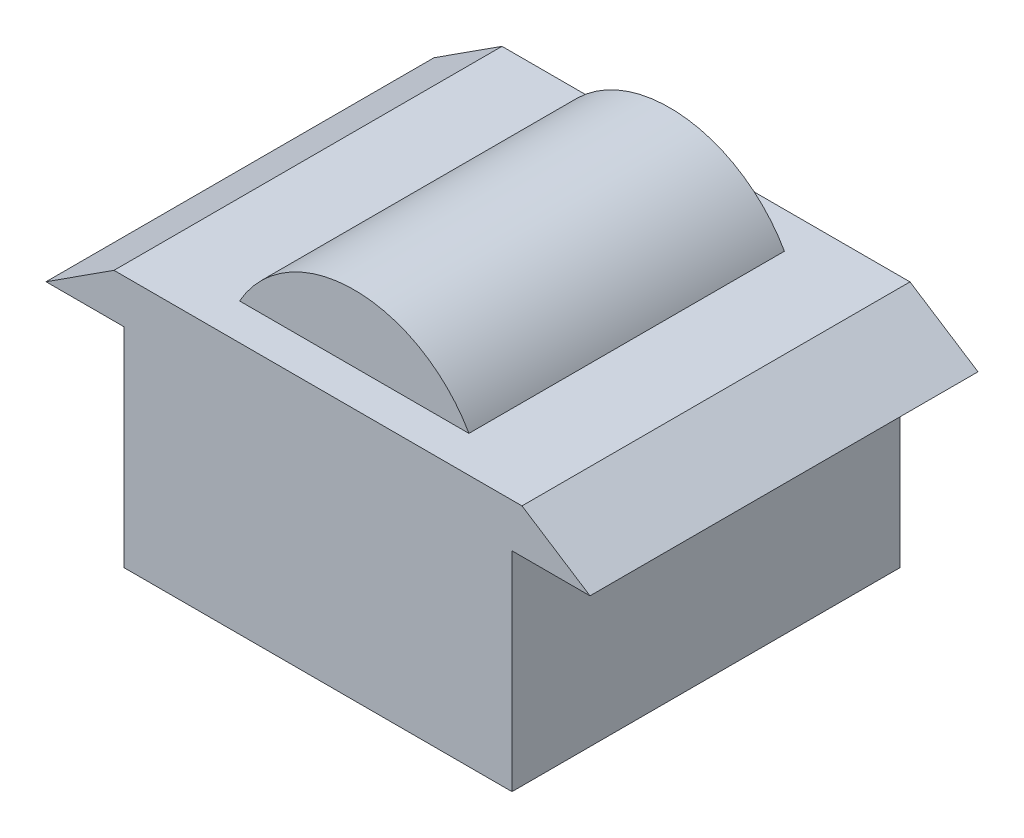
ISO-10303-21;
HEADER;
FILE_DESCRIPTION(('STEP AP214'),'2;1');
FILE_NAME('part.step','',(''),(''),'','','');
FILE_SCHEMA(('AUTOMOTIVE_DESIGN { 1 0 10303 214 1 1 1 1 }'));
ENDSEC;
DATA;
#1=APPLICATION_CONTEXT('core data for automotive mechanical design processes');
#2=APPLICATION_PROTOCOL_DEFINITION('international standard','automotive_design',2000,#1);
#3=PRODUCT_CONTEXT('',#1,'mechanical');
#4=PRODUCT('Part','Part','',(#3));
#5=PRODUCT_RELATED_PRODUCT_CATEGORY('part','',(#4));
#6=PRODUCT_DEFINITION_FORMATION('','',#4);
#7=PRODUCT_DEFINITION_CONTEXT('part definition',#1,'design');
#8=PRODUCT_DEFINITION('design','',#6,#7);
#9=PRODUCT_DEFINITION_SHAPE('','',#8);
#10=(LENGTH_UNIT() NAMED_UNIT(*) SI_UNIT(.MILLI.,.METRE.));
#11=(NAMED_UNIT(*) PLANE_ANGLE_UNIT() SI_UNIT($,.RADIAN.));
#12=(NAMED_UNIT(*) SI_UNIT($,.STERADIAN.) SOLID_ANGLE_UNIT());
#13=UNCERTAINTY_MEASURE_WITH_UNIT(LENGTH_MEASURE(1.E-05),#10,'distance_accuracy_value','');
#14=(GEOMETRIC_REPRESENTATION_CONTEXT(3) GLOBAL_UNCERTAINTY_ASSIGNED_CONTEXT((#13)) GLOBAL_UNIT_ASSIGNED_CONTEXT((#10,
#11,#12)) REPRESENTATION_CONTEXT('',''));
#15=CARTESIAN_POINT('',(0.,0.,0.));
#16=DIRECTION('',(0.,0.,1.));
#17=DIRECTION('',(1.,0.,0.));
#18=AXIS2_PLACEMENT_3D('',#15,#16,#17);
#19=CARTESIAN_POINT('',(0.,0.,22.225));
#20=DIRECTION('',(0.,0.,-1.));
#21=DIRECTION('',(-1.,0.,0.));
#22=AXIS2_PLACEMENT_3D('',#19,#20,#21);
#23=CYLINDRICAL_SURFACE('',#22,15.08125);
#24=CARTESIAN_POINT('',(0.,0.,18.0704000974004));
#25=DIRECTION('',(0.,0.,1.));
#26=DIRECTION('',(1.,0.,0.));
#27=AXIS2_PLACEMENT_3D('',#24,#25,#26);
#28=CIRCLE('',#27,15.08125);
#29=CARTESIAN_POINT('',(13.136969409921,7.40703289349392,18.0704000974004));
#30=VERTEX_POINT('',#29);
#31=CARTESIAN_POINT('',(-13.136969409921,7.40703289349392,18.0704000974004));
#32=VERTEX_POINT('',#31);
#33=EDGE_CURVE('E179',#30,#32,#28,.T.);
#34=ORIENTED_EDGE('',*,*,#33,.F.);
#35=DIRECTION('',(0.,0.,-1.));
#36=VECTOR('',#35,1.);
#37=CARTESIAN_POINT('',(13.136969409921,7.40703289349392,22.225));
#38=LINE('',#37,#36);
#39=CARTESIAN_POINT('',(13.136969409921,7.40703289349392,-18.0704000974004));
#40=VERTEX_POINT('',#39);
#41=EDGE_CURVE('E127',#30,#40,#38,.T.);
#42=ORIENTED_EDGE('',*,*,#41,.T.);
#43=CARTESIAN_POINT('',(0.,0.,-18.0704000974004));
#44=DIRECTION('',(0.,0.,-1.));
#45=DIRECTION('',(-1.,0.,0.));
#46=AXIS2_PLACEMENT_3D('',#43,#44,#45);
#47=CIRCLE('',#46,15.08125);
#48=CARTESIAN_POINT('',(-13.136969409921,7.40703289349392,-18.0704000974004));
#49=VERTEX_POINT('',#48);
#50=EDGE_CURVE('E11',#49,#40,#47,.T.);
#51=ORIENTED_EDGE('',*,*,#50,.F.);
#52=DIRECTION('',(0.,0.,-1.));
#53=VECTOR('',#52,1.);
#54=CARTESIAN_POINT('',(-13.136969409921,7.40703289349392,22.225));
#55=LINE('',#54,#53);
#56=EDGE_CURVE('E40',#32,#49,#55,.T.);
#57=ORIENTED_EDGE('',*,*,#56,.F.);
#58=EDGE_LOOP('',(#34,#42,#51,#57));
#59=FACE_BOUND('',#58,.T.);
#60=ADVANCED_FACE('F32',(#59),#23,.T.);
#61=CARTESIAN_POINT('',(-23.3698904547467,7.40703289349392,22.225));
#62=DIRECTION('',(0.542126869822094,-0.840296648224244,0.));
#63=DIRECTION('',(0.840296648224244,0.542126869822094,0.));
#64=AXIS2_PLACEMENT_3D('',#61,#62,#63);
#65=PLANE('',#64);
#66=DIRECTION('',(-0.840296648224244,-0.542126869822094,0.));
#67=VECTOR('',#66,1.);
#68=CARTESIAN_POINT('',(-23.3698904547467,7.40703289349392,-22.225));
#69=LINE('',#68,#67);
#70=CARTESIAN_POINT('',(-23.3698904547467,7.40703289349392,-22.225));
#71=VERTEX_POINT('',#70);
#72=CARTESIAN_POINT('',(-31.1598539396623,2.38125,-22.225));
#73=VERTEX_POINT('',#72);
#74=EDGE_CURVE('E131',#71,#73,#69,.T.);
#75=ORIENTED_EDGE('',*,*,#74,.T.);
#76=DIRECTION('',(0.,0.,-1.));
#77=VECTOR('',#76,1.);
#78=CARTESIAN_POINT('',(-31.1598539396623,2.38125,22.225));
#79=LINE('',#78,#77);
#80=CARTESIAN_POINT('',(-31.1598539396623,2.38125,22.225));
#81=VERTEX_POINT('',#80);
#82=EDGE_CURVE('E157',#81,#73,#79,.T.);
#83=ORIENTED_EDGE('',*,*,#82,.F.);
#84=DIRECTION('',(-0.840296648224244,-0.542126869822094,0.));
#85=VECTOR('',#84,1.);
#86=CARTESIAN_POINT('',(-23.3698904547467,7.40703289349392,22.225));
#87=LINE('',#86,#85);
#88=CARTESIAN_POINT('',(-23.3698904547467,7.40703289349392,22.225));
#89=VERTEX_POINT('',#88);
#90=EDGE_CURVE('E191',#89,#81,#87,.T.);
#91=ORIENTED_EDGE('',*,*,#90,.F.);
#92=DIRECTION('',(0.,0.,-1.));
#93=VECTOR('',#92,1.);
#94=CARTESIAN_POINT('',(-23.3698904547467,7.40703289349392,22.225));
#95=LINE('',#94,#93);
#96=EDGE_CURVE('E160',#89,#71,#95,.T.);
#97=ORIENTED_EDGE('',*,*,#96,.T.);
#98=EDGE_LOOP('',(#75,#83,#91,#97));
#99=FACE_BOUND('',#98,.T.);
#100=ADVANCED_FACE('F213',(#99),#65,.F.);
#101=CARTESIAN_POINT('',(-31.1598539396623,2.38125,22.225));
#102=DIRECTION('',(0.,1.,0.));
#103=DIRECTION('',(-1.,0.,0.));
#104=AXIS2_PLACEMENT_3D('',#101,#102,#103);
#105=PLANE('',#104);
#106=DIRECTION('',(1.,0.,0.));
#107=VECTOR('',#106,1.);
#108=CARTESIAN_POINT('',(-31.1598539396623,2.38125,-22.225));
#109=LINE('',#108,#107);
#110=CARTESIAN_POINT('',(-22.225,2.38125,-22.225));
#111=VERTEX_POINT('',#110);
#112=EDGE_CURVE('E133',#73,#111,#109,.T.);
#113=ORIENTED_EDGE('',*,*,#112,.T.);
#114=DIRECTION('',(0.,0.,-1.));
#115=VECTOR('',#114,1.);
#116=CARTESIAN_POINT('',(-22.225,2.38125,22.225));
#117=LINE('',#116,#115);
#118=CARTESIAN_POINT('',(-22.225,2.38125,22.225));
#119=VERTEX_POINT('',#118);
#120=EDGE_CURVE('E154',#119,#111,#117,.T.);
#121=ORIENTED_EDGE('',*,*,#120,.F.);
#122=DIRECTION('',(1.,0.,0.));
#123=VECTOR('',#122,1.);
#124=CARTESIAN_POINT('',(-31.1598539396623,2.38125,22.225));
#125=LINE('',#124,#123);
#126=EDGE_CURVE('E193',#81,#119,#125,.T.);
#127=ORIENTED_EDGE('',*,*,#126,.F.);
#128=ORIENTED_EDGE('',*,*,#82,.T.);
#129=EDGE_LOOP('',(#113,#121,#127,#128));
#130=FACE_BOUND('',#129,.T.);
#131=ADVANCED_FACE('F216',(#130),#105,.F.);
#132=CARTESIAN_POINT('',(-22.225,2.38125,22.225));
#133=DIRECTION('',(1.,0.,0.));
#134=DIRECTION('',(0.,1.,0.));
#135=AXIS2_PLACEMENT_3D('',#132,#133,#134);
#136=PLANE('',#135);
#137=DIRECTION('',(0.,-1.,0.));
#138=VECTOR('',#137,1.);
#139=CARTESIAN_POINT('',(-22.225,2.38125,-22.225));
#140=LINE('',#139,#138);
#141=CARTESIAN_POINT('',(-22.225,-21.51875,-22.225));
#142=VERTEX_POINT('',#141);
#143=EDGE_CURVE('E136',#111,#142,#140,.T.);
#144=ORIENTED_EDGE('',*,*,#143,.T.);
#145=DIRECTION('',(0.,0.,-1.));
#146=VECTOR('',#145,1.);
#147=CARTESIAN_POINT('',(-22.225,-21.51875,22.225));
#148=LINE('',#147,#146);
#149=CARTESIAN_POINT('',(-22.225,-21.51875,22.225));
#150=VERTEX_POINT('',#149);
#151=EDGE_CURVE('E151',#150,#142,#148,.T.);
#152=ORIENTED_EDGE('',*,*,#151,.F.);
#153=DIRECTION('',(0.,-1.,0.));
#154=VECTOR('',#153,1.);
#155=CARTESIAN_POINT('',(-22.225,2.38125,22.225));
#156=LINE('',#155,#154);
#157=EDGE_CURVE('E195',#119,#150,#156,.T.);
#158=ORIENTED_EDGE('',*,*,#157,.F.);
#159=ORIENTED_EDGE('',*,*,#120,.T.);
#160=EDGE_LOOP('',(#144,#152,#158,#159));
#161=FACE_BOUND('',#160,.T.);
#162=ADVANCED_FACE('F201',(#161),#136,.F.);
#163=CARTESIAN_POINT('',(22.225,-21.51875,22.225));
#164=DIRECTION('',(0.,1.,0.));
#165=DIRECTION('',(0.,0.,1.));
#166=AXIS2_PLACEMENT_3D('',#163,#164,#165);
#167=PLANE('',#166);
#168=DIRECTION('',(1.,0.,0.));
#169=VECTOR('',#168,1.);
#170=CARTESIAN_POINT('',(22.225,-21.51875,-22.225));
#171=LINE('',#170,#169);
#172=CARTESIAN_POINT('',(22.225,-21.51875,-22.225));
#173=VERTEX_POINT('',#172);
#174=EDGE_CURVE('E138',#142,#173,#171,.T.);
#175=ORIENTED_EDGE('',*,*,#174,.T.);
#176=DIRECTION('',(0.,0.,-1.));
#177=VECTOR('',#176,1.);
#178=CARTESIAN_POINT('',(22.225,-21.51875,22.225));
#179=LINE('',#178,#177);
#180=CARTESIAN_POINT('',(22.225,-21.51875,22.225));
#181=VERTEX_POINT('',#180);
#182=EDGE_CURVE('E120',#181,#173,#179,.T.);
#183=ORIENTED_EDGE('',*,*,#182,.F.);
#184=DIRECTION('',(1.,0.,0.));
#185=VECTOR('',#184,1.);
#186=CARTESIAN_POINT('',(22.225,-21.51875,22.225));
#187=LINE('',#186,#185);
#188=EDGE_CURVE('E111',#150,#181,#187,.T.);
#189=ORIENTED_EDGE('',*,*,#188,.F.);
#190=ORIENTED_EDGE('',*,*,#151,.T.);
#191=EDGE_LOOP('',(#175,#183,#189,#190));
#192=FACE_BOUND('',#191,.T.);
#193=ADVANCED_FACE('F205',(#192),#167,.F.);
#194=CARTESIAN_POINT('',(22.225,2.38125,22.225));
#195=DIRECTION('',(-1.,0.,0.));
#196=DIRECTION('',(0.,-1.,0.));
#197=AXIS2_PLACEMENT_3D('',#194,#195,#196);
#198=PLANE('',#197);
#199=DIRECTION('',(0.,1.,0.));
#200=VECTOR('',#199,1.);
#201=CARTESIAN_POINT('',(22.225,2.38125,-22.225));
#202=LINE('',#201,#200);
#203=CARTESIAN_POINT('',(22.225,2.38125,-22.225));
#204=VERTEX_POINT('',#203);
#205=EDGE_CURVE('E119',#173,#204,#202,.T.);
#206=ORIENTED_EDGE('',*,*,#205,.T.);
#207=DIRECTION('',(0.,0.,-1.));
#208=VECTOR('',#207,1.);
#209=CARTESIAN_POINT('',(22.225,2.38125,22.225));
#210=LINE('',#209,#208);
#211=CARTESIAN_POINT('',(22.225,2.38125,22.225));
#212=VERTEX_POINT('',#211);
#213=EDGE_CURVE('E116',#212,#204,#210,.T.);
#214=ORIENTED_EDGE('',*,*,#213,.F.);
#215=DIRECTION('',(0.,1.,0.));
#216=VECTOR('',#215,1.);
#217=CARTESIAN_POINT('',(22.225,2.38125,22.225));
#218=LINE('',#217,#216);
#219=EDGE_CURVE('E105',#181,#212,#218,.T.);
#220=ORIENTED_EDGE('',*,*,#219,.F.);
#221=ORIENTED_EDGE('',*,*,#182,.T.);
#222=EDGE_LOOP('',(#206,#214,#220,#221));
#223=FACE_BOUND('',#222,.T.);
#224=ADVANCED_FACE('F117',(#223),#198,.F.);
#225=CARTESIAN_POINT('',(31.1598539396623,2.38125,22.225));
#226=DIRECTION('',(0.,1.,0.));
#227=DIRECTION('',(-1.,0.,0.));
#228=AXIS2_PLACEMENT_3D('',#225,#226,#227);
#229=PLANE('',#228);
#230=DIRECTION('',(1.,0.,0.));
#231=VECTOR('',#230,1.);
#232=CARTESIAN_POINT('',(31.1598539396623,2.38125,-22.225));
#233=LINE('',#232,#231);
#234=CARTESIAN_POINT('',(31.1598539396623,2.38125,-22.225));
#235=VERTEX_POINT('',#234);
#236=EDGE_CURVE('E79',#204,#235,#233,.T.);
#237=ORIENTED_EDGE('',*,*,#236,.T.);
#238=DIRECTION('',(0.,0.,-1.));
#239=VECTOR('',#238,1.);
#240=CARTESIAN_POINT('',(31.1598539396623,2.38125,22.225));
#241=LINE('',#240,#239);
#242=CARTESIAN_POINT('',(31.1598539396623,2.38125,22.225));
#243=VERTEX_POINT('',#242);
#244=EDGE_CURVE('E121',#243,#235,#241,.T.);
#245=ORIENTED_EDGE('',*,*,#244,.F.);
#246=DIRECTION('',(1.,0.,0.));
#247=VECTOR('',#246,1.);
#248=CARTESIAN_POINT('',(31.1598539396623,2.38125,22.225));
#249=LINE('',#248,#247);
#250=EDGE_CURVE('E109',#212,#243,#249,.T.);
#251=ORIENTED_EDGE('',*,*,#250,.F.);
#252=ORIENTED_EDGE('',*,*,#213,.T.);
#253=EDGE_LOOP('',(#237,#245,#251,#252));
#254=FACE_BOUND('',#253,.T.);
#255=ADVANCED_FACE('F123',(#254),#229,.F.);
#256=CARTESIAN_POINT('',(23.3698904547467,7.40703289349392,22.225));
#257=DIRECTION('',(-0.542126869822094,-0.840296648224244,0.));
#258=DIRECTION('',(0.840296648224244,-0.542126869822094,0.));
#259=AXIS2_PLACEMENT_3D('',#256,#257,#258);
#260=PLANE('',#259);
#261=DIRECTION('',(-0.840296648224244,0.542126869822094,0.));
#262=VECTOR('',#261,1.);
#263=CARTESIAN_POINT('',(23.3698904547467,7.40703289349392,-22.225));
#264=LINE('',#263,#262);
#265=CARTESIAN_POINT('',(23.3698904547467,7.40703289349392,-22.225));
#266=VERTEX_POINT('',#265);
#267=EDGE_CURVE('E86',#235,#266,#264,.T.);
#268=ORIENTED_EDGE('',*,*,#267,.T.);
#269=DIRECTION('',(0.,0.,-1.));
#270=VECTOR('',#269,1.);
#271=CARTESIAN_POINT('',(23.3698904547467,7.40703289349392,22.225));
#272=LINE('',#271,#270);
#273=CARTESIAN_POINT('',(23.3698904547467,7.40703289349392,22.225));
#274=VERTEX_POINT('',#273);
#275=EDGE_CURVE('E147',#274,#266,#272,.T.);
#276=ORIENTED_EDGE('',*,*,#275,.F.);
#277=DIRECTION('',(-0.840296648224244,0.542126869822094,0.));
#278=VECTOR('',#277,1.);
#279=CARTESIAN_POINT('',(23.3698904547467,7.40703289349392,22.225));
#280=LINE('',#279,#278);
#281=EDGE_CURVE('E125',#243,#274,#280,.T.);
#282=ORIENTED_EDGE('',*,*,#281,.F.);
#283=ORIENTED_EDGE('',*,*,#244,.T.);
#284=EDGE_LOOP('',(#268,#276,#282,#283));
#285=FACE_BOUND('',#284,.T.);
#286=ADVANCED_FACE('F267',(#285),#260,.F.);
#287=CARTESIAN_POINT('',(13.136969409921,7.40703289349392,22.225));
#288=DIRECTION('',(0.,-1.,0.));
#289=DIRECTION('',(0.,0.,-1.));
#290=AXIS2_PLACEMENT_3D('',#287,#288,#289);
#291=PLANE('',#290);
#292=ORIENTED_EDGE('',*,*,#41,.F.);
#293=DIRECTION('',(-1.,0.,0.));
#294=VECTOR('',#293,1.);
#295=CARTESIAN_POINT('',(13.136969409921,7.40703289349392,18.0704000974004));
#296=LINE('',#295,#294);
#297=EDGE_CURVE('E173',#30,#32,#296,.T.);
#298=ORIENTED_EDGE('',*,*,#297,.T.);
#299=ORIENTED_EDGE('',*,*,#56,.T.);
#300=DIRECTION('',(1.,0.,0.));
#301=VECTOR('',#300,1.);
#302=CARTESIAN_POINT('',(13.136969409921,7.40703289349392,-18.0704000974004));
#303=LINE('',#302,#301);
#304=EDGE_CURVE('E134',#49,#40,#303,.T.);
#305=ORIENTED_EDGE('',*,*,#304,.T.);
#306=EDGE_LOOP('',(#292,#298,#299,#305));
#307=FACE_BOUND('',#306,.T.);
#308=DIRECTION('',(-1.,0.,0.));
#309=VECTOR('',#308,1.);
#310=CARTESIAN_POINT('',(13.136969409921,7.40703289349392,-22.225));
#311=LINE('',#310,#309);
#312=EDGE_CURVE('E143',#266,#71,#311,.T.);
#313=ORIENTED_EDGE('',*,*,#312,.T.);
#314=ORIENTED_EDGE('',*,*,#96,.F.);
#315=DIRECTION('',(-1.,0.,0.));
#316=VECTOR('',#315,1.);
#317=CARTESIAN_POINT('',(-23.3698904547467,7.40703289349392,22.225));
#318=LINE('',#317,#316);
#319=EDGE_CURVE('E48',#274,#89,#318,.T.);
#320=ORIENTED_EDGE('',*,*,#319,.F.);
#321=ORIENTED_EDGE('',*,*,#275,.T.);
#322=EDGE_LOOP('',(#313,#314,#320,#321));
#323=FACE_BOUND('',#322,.T.);
#324=ADVANCED_FACE('F170',(#307,#323),#291,.F.);
#325=CARTESIAN_POINT('',(0.,0.,22.225));
#326=DIRECTION('',(0.,0.,1.));
#327=DIRECTION('',(1.,0.,0.));
#328=AXIS2_PLACEMENT_3D('',#325,#326,#327);
#329=PLANE('',#328);
#330=ORIENTED_EDGE('',*,*,#281,.T.);
#331=ORIENTED_EDGE('',*,*,#319,.T.);
#332=ORIENTED_EDGE('',*,*,#90,.T.);
#333=ORIENTED_EDGE('',*,*,#126,.T.);
#334=ORIENTED_EDGE('',*,*,#157,.T.);
#335=ORIENTED_EDGE('',*,*,#188,.T.);
#336=ORIENTED_EDGE('',*,*,#219,.T.);
#337=ORIENTED_EDGE('',*,*,#250,.T.);
#338=EDGE_LOOP('',(#330,#331,#332,#333,#334,#335,#336,#337));
#339=FACE_BOUND('',#338,.T.);
#340=ADVANCED_FACE('F107',(#339),#329,.T.);
#341=CARTESIAN_POINT('',(0.,0.,-22.225));
#342=DIRECTION('',(0.,0.,1.));
#343=DIRECTION('',(1.,0.,0.));
#344=AXIS2_PLACEMENT_3D('',#341,#342,#343);
#345=PLANE('',#344);
#346=ORIENTED_EDGE('',*,*,#74,.F.);
#347=ORIENTED_EDGE('',*,*,#312,.F.);
#348=ORIENTED_EDGE('',*,*,#267,.F.);
#349=ORIENTED_EDGE('',*,*,#236,.F.);
#350=ORIENTED_EDGE('',*,*,#205,.F.);
#351=ORIENTED_EDGE('',*,*,#174,.F.);
#352=ORIENTED_EDGE('',*,*,#143,.F.);
#353=ORIENTED_EDGE('',*,*,#112,.F.);
#354=EDGE_LOOP('',(#346,#347,#348,#349,#350,#351,#352,#353));
#355=FACE_BOUND('',#354,.T.);
#356=ADVANCED_FACE('F208',(#355),#345,.F.);
#357=CARTESIAN_POINT('',(13.136969409921,51.8570328934939,-18.0704000974004));
#358=DIRECTION('',(0.,0.,-1.));
#359=DIRECTION('',(-1.,0.,0.));
#360=AXIS2_PLACEMENT_3D('',#357,#358,#359);
#361=PLANE('',#360);
#362=ORIENTED_EDGE('',*,*,#50,.T.);
#363=ORIENTED_EDGE('',*,*,#304,.F.);
#364=EDGE_LOOP('',(#362,#363));
#365=FACE_BOUND('',#364,.T.);
#366=ADVANCED_FACE('F178',(#365),#361,.T.);
#367=CARTESIAN_POINT('',(13.136969409921,51.8570328934939,18.0704000974004));
#368=DIRECTION('',(0.,0.,1.));
#369=DIRECTION('',(1.,0.,0.));
#370=AXIS2_PLACEMENT_3D('',#367,#368,#369);
#371=PLANE('',#370);
#372=ORIENTED_EDGE('',*,*,#33,.T.);
#373=ORIENTED_EDGE('',*,*,#297,.F.);
#374=EDGE_LOOP('',(#372,#373));
#375=FACE_BOUND('',#374,.T.);
#376=ADVANCED_FACE('F186',(#375),#371,.T.);
#377=CLOSED_SHELL('',(#60,#100,#131,#162,#193,#224,#255,#286,#324,#340,#356,#366,#376));
#378=MANIFOLD_SOLID_BREP('B2',#377);
#379=ADVANCED_BREP_SHAPE_REPRESENTATION('',(#18,#378),#14);
#380=SHAPE_DEFINITION_REPRESENTATION(#9,#379);
ENDSEC;
END-ISO-10303-21;
